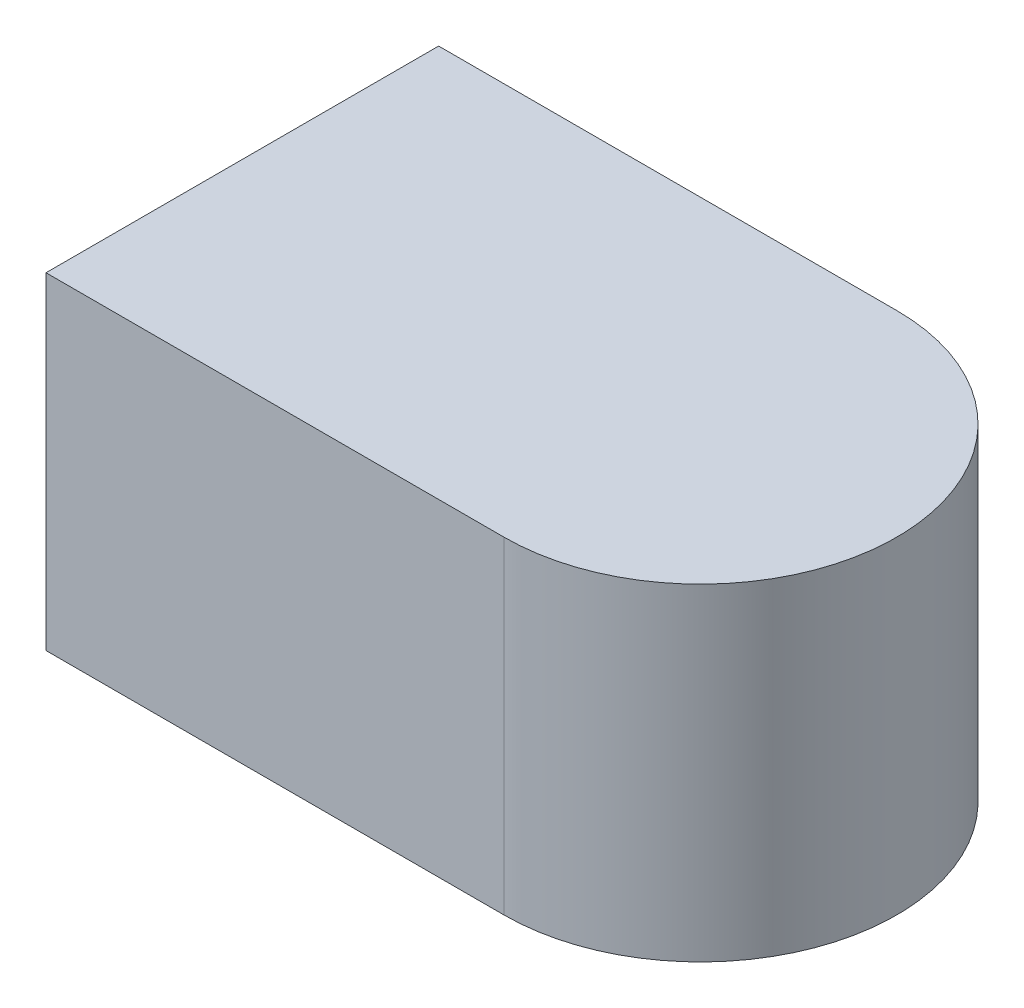
ISO-10303-21;
HEADER;
FILE_DESCRIPTION(('STEP AP214'),'2;1');
FILE_NAME('part.step','',(''),(''),'','','');
FILE_SCHEMA(('AUTOMOTIVE_DESIGN { 1 0 10303 214 1 1 1 1 }'));
ENDSEC;
DATA;
#1=APPLICATION_CONTEXT('core data for automotive mechanical design processes');
#2=APPLICATION_PROTOCOL_DEFINITION('international standard','automotive_design',2000,#1);
#3=PRODUCT_CONTEXT('',#1,'mechanical');
#4=PRODUCT('Part','Part','',(#3));
#5=PRODUCT_RELATED_PRODUCT_CATEGORY('part','',(#4));
#6=PRODUCT_DEFINITION_FORMATION('','',#4);
#7=PRODUCT_DEFINITION_CONTEXT('part definition',#1,'design');
#8=PRODUCT_DEFINITION('design','',#6,#7);
#9=PRODUCT_DEFINITION_SHAPE('','',#8);
#10=(LENGTH_UNIT() NAMED_UNIT(*) SI_UNIT(.MILLI.,.METRE.));
#11=(NAMED_UNIT(*) PLANE_ANGLE_UNIT() SI_UNIT($,.RADIAN.));
#12=(NAMED_UNIT(*) SI_UNIT($,.STERADIAN.) SOLID_ANGLE_UNIT());
#13=UNCERTAINTY_MEASURE_WITH_UNIT(LENGTH_MEASURE(1.E-05),#10,'distance_accuracy_value','');
#14=(GEOMETRIC_REPRESENTATION_CONTEXT(3) GLOBAL_UNCERTAINTY_ASSIGNED_CONTEXT((#13)) GLOBAL_UNIT_ASSIGNED_CONTEXT((#10,
#11,#12)) REPRESENTATION_CONTEXT('',''));
#15=CARTESIAN_POINT('',(0.,0.,0.));
#16=DIRECTION('',(0.,0.,1.));
#17=DIRECTION('',(1.,0.,0.));
#18=AXIS2_PLACEMENT_3D('',#15,#16,#17);
#19=CARTESIAN_POINT('',(0.,0.,0.));
#20=DIRECTION('',(0.,-1.,0.));
#21=DIRECTION('',(-1.,0.,0.));
#22=AXIS2_PLACEMENT_3D('',#19,#20,#21);
#23=PLANE('',#22);
#24=CARTESIAN_POINT('',(-1.47,0.,1.25));
#25=DIRECTION('',(0.,-1.,0.));
#26=DIRECTION('',(0.,0.,-1.));
#27=AXIS2_PLACEMENT_3D('',#24,#25,#26);
#28=CIRCLE('',#27,0.12);
#29=CARTESIAN_POINT('',(-1.47,0.,1.13));
#30=VERTEX_POINT('',#29);
#31=CARTESIAN_POINT('',(-1.47,0.,1.37));
#32=VERTEX_POINT('',#31);
#33=EDGE_CURVE('E11',#30,#32,#28,.T.);
#34=ORIENTED_EDGE('',*,*,#33,.T.);
#35=DIRECTION('',(-1.,0.,0.));
#36=VECTOR('',#35,1.);
#37=CARTESIAN_POINT('',(-1.47,0.,1.37));
#38=LINE('',#37,#36);
#39=CARTESIAN_POINT('',(-1.75,0.,1.37));
#40=VERTEX_POINT('',#39);
#41=EDGE_CURVE('E24',#32,#40,#38,.T.);
#42=ORIENTED_EDGE('',*,*,#41,.T.);
#43=DIRECTION('',(0.,0.,-1.));
#44=VECTOR('',#43,1.);
#45=CARTESIAN_POINT('',(-1.75,0.,1.37));
#46=LINE('',#45,#44);
#47=CARTESIAN_POINT('',(-1.75,0.,1.13));
#48=VERTEX_POINT('',#47);
#49=EDGE_CURVE('E62',#40,#48,#46,.T.);
#50=ORIENTED_EDGE('',*,*,#49,.T.);
#51=DIRECTION('',(1.,0.,0.));
#52=VECTOR('',#51,1.);
#53=CARTESIAN_POINT('',(-1.75,0.,1.13));
#54=LINE('',#53,#52);
#55=EDGE_CURVE('E36',#48,#30,#54,.T.);
#56=ORIENTED_EDGE('',*,*,#55,.T.);
#57=EDGE_LOOP('',(#34,#42,#50,#56));
#58=FACE_BOUND('',#57,.T.);
#59=ADVANCED_FACE('F17',(#58),#23,.T.);
#60=CARTESIAN_POINT('',(-1.75,0.,1.13));
#61=DIRECTION('',(0.,0.,1.));
#62=DIRECTION('',(1.,0.,0.));
#63=AXIS2_PLACEMENT_3D('',#60,#61,#62);
#64=PLANE('',#63);
#65=DIRECTION('',(0.,1.,0.));
#66=VECTOR('',#65,1.);
#67=CARTESIAN_POINT('',(-1.75,0.,1.13));
#68=LINE('',#67,#66);
#69=CARTESIAN_POINT('',(-1.75,0.2,1.13));
#70=VERTEX_POINT('',#69);
#71=EDGE_CURVE('E84',#48,#70,#68,.T.);
#72=ORIENTED_EDGE('',*,*,#71,.T.);
#73=DIRECTION('',(1.,0.,0.));
#74=VECTOR('',#73,1.);
#75=CARTESIAN_POINT('',(-1.75,0.2,1.13));
#76=LINE('',#75,#74);
#77=CARTESIAN_POINT('',(-1.47,0.2,1.13));
#78=VERTEX_POINT('',#77);
#79=EDGE_CURVE('E74',#70,#78,#76,.T.);
#80=ORIENTED_EDGE('',*,*,#79,.T.);
#81=DIRECTION('',(0.,1.,0.));
#82=VECTOR('',#81,1.);
#83=CARTESIAN_POINT('',(-1.47,0.,1.13));
#84=LINE('',#83,#82);
#85=EDGE_CURVE('E81',#30,#78,#84,.T.);
#86=ORIENTED_EDGE('',*,*,#85,.F.);
#87=ORIENTED_EDGE('',*,*,#55,.F.);
#88=EDGE_LOOP('',(#72,#80,#86,#87));
#89=FACE_BOUND('',#88,.T.);
#90=ADVANCED_FACE('F91',(#89),#64,.F.);
#91=CARTESIAN_POINT('',(-1.47,0.,1.25));
#92=DIRECTION('',(0.,-1.,0.));
#93=DIRECTION('',(-1.,0.,0.));
#94=AXIS2_PLACEMENT_3D('',#91,#92,#93);
#95=CYLINDRICAL_SURFACE('',#94,0.12);
#96=ORIENTED_EDGE('',*,*,#85,.T.);
#97=CARTESIAN_POINT('',(-1.47,0.2,1.25));
#98=DIRECTION('',(0.,-1.,0.));
#99=DIRECTION('',(0.,0.,-1.));
#100=AXIS2_PLACEMENT_3D('',#97,#98,#99);
#101=CIRCLE('',#100,0.12);
#102=CARTESIAN_POINT('',(-1.47,0.2,1.37));
#103=VERTEX_POINT('',#102);
#104=EDGE_CURVE('E79',#78,#103,#101,.T.);
#105=ORIENTED_EDGE('',*,*,#104,.T.);
#106=DIRECTION('',(0.,1.,0.));
#107=VECTOR('',#106,1.);
#108=CARTESIAN_POINT('',(-1.47,0.,1.37));
#109=LINE('',#108,#107);
#110=EDGE_CURVE('E68',#32,#103,#109,.T.);
#111=ORIENTED_EDGE('',*,*,#110,.F.);
#112=ORIENTED_EDGE('',*,*,#33,.F.);
#113=EDGE_LOOP('',(#96,#105,#111,#112));
#114=FACE_BOUND('',#113,.T.);
#115=ADVANCED_FACE('F89',(#114),#95,.T.);
#116=CARTESIAN_POINT('',(-1.47,0.,1.37));
#117=DIRECTION('',(0.,0.,-1.));
#118=DIRECTION('',(-1.,0.,0.));
#119=AXIS2_PLACEMENT_3D('',#116,#117,#118);
#120=PLANE('',#119);
#121=ORIENTED_EDGE('',*,*,#110,.T.);
#122=DIRECTION('',(-1.,0.,0.));
#123=VECTOR('',#122,1.);
#124=CARTESIAN_POINT('',(-1.47,0.2,1.37));
#125=LINE('',#124,#123);
#126=CARTESIAN_POINT('',(-1.75,0.2,1.37));
#127=VERTEX_POINT('',#126);
#128=EDGE_CURVE('E63',#103,#127,#125,.T.);
#129=ORIENTED_EDGE('',*,*,#128,.T.);
#130=DIRECTION('',(0.,1.,0.));
#131=VECTOR('',#130,1.);
#132=CARTESIAN_POINT('',(-1.75,0.,1.37));
#133=LINE('',#132,#131);
#134=EDGE_CURVE('E56',#40,#127,#133,.T.);
#135=ORIENTED_EDGE('',*,*,#134,.F.);
#136=ORIENTED_EDGE('',*,*,#41,.F.);
#137=EDGE_LOOP('',(#121,#129,#135,#136));
#138=FACE_BOUND('',#137,.T.);
#139=ADVANCED_FACE('F66',(#138),#120,.F.);
#140=CARTESIAN_POINT('',(-1.75,0.,1.37));
#141=DIRECTION('',(1.,0.,0.));
#142=DIRECTION('',(0.,0.,-1.));
#143=AXIS2_PLACEMENT_3D('',#140,#141,#142);
#144=PLANE('',#143);
#145=ORIENTED_EDGE('',*,*,#134,.T.);
#146=DIRECTION('',(0.,0.,-1.));
#147=VECTOR('',#146,1.);
#148=CARTESIAN_POINT('',(-1.75,0.2,1.37));
#149=LINE('',#148,#147);
#150=EDGE_CURVE('E61',#127,#70,#149,.T.);
#151=ORIENTED_EDGE('',*,*,#150,.T.);
#152=ORIENTED_EDGE('',*,*,#71,.F.);
#153=ORIENTED_EDGE('',*,*,#49,.F.);
#154=EDGE_LOOP('',(#145,#151,#152,#153));
#155=FACE_BOUND('',#154,.T.);
#156=ADVANCED_FACE('F58',(#155),#144,.F.);
#157=CARTESIAN_POINT('',(0.,0.2,0.));
#158=DIRECTION('',(0.,-1.,0.));
#159=DIRECTION('',(-1.,0.,0.));
#160=AXIS2_PLACEMENT_3D('',#157,#158,#159);
#161=PLANE('',#160);
#162=ORIENTED_EDGE('',*,*,#150,.F.);
#163=ORIENTED_EDGE('',*,*,#128,.F.);
#164=ORIENTED_EDGE('',*,*,#104,.F.);
#165=ORIENTED_EDGE('',*,*,#79,.F.);
#166=EDGE_LOOP('',(#162,#163,#164,#165));
#167=FACE_BOUND('',#166,.T.);
#168=ADVANCED_FACE('F72',(#167),#161,.F.);
#169=CLOSED_SHELL('',(#59,#90,#115,#139,#156,#168));
#170=MANIFOLD_SOLID_BREP('B1',#169);
#171=ADVANCED_BREP_SHAPE_REPRESENTATION('',(#18,#170),#14);
#172=SHAPE_DEFINITION_REPRESENTATION(#9,#171);
ENDSEC;
END-ISO-10303-21;
